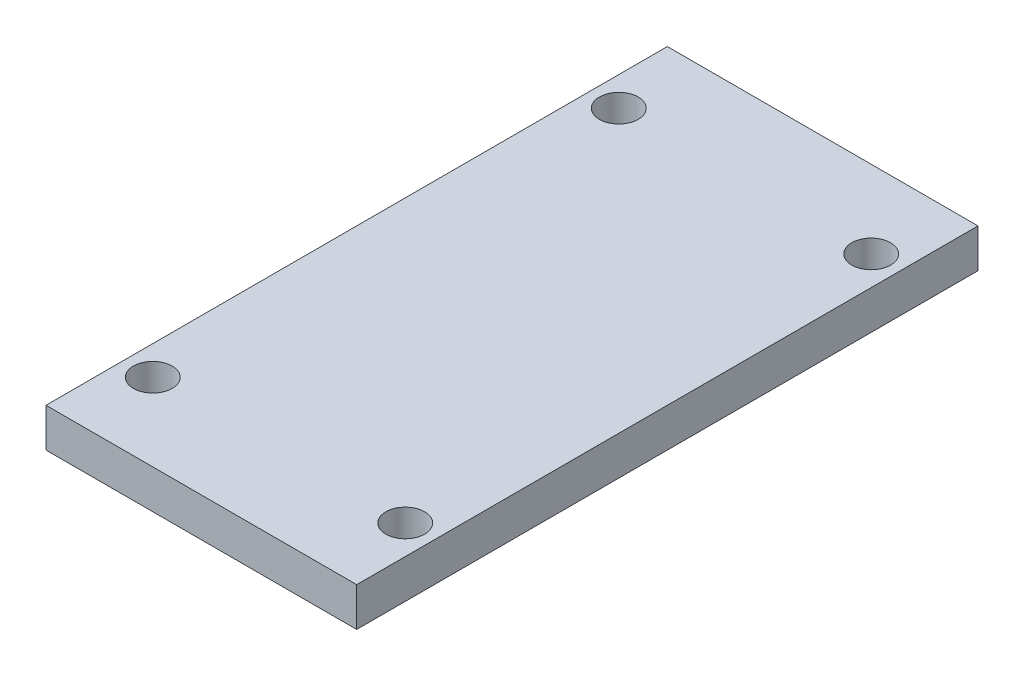
ISO-10303-21;
HEADER;
FILE_DESCRIPTION(('STEP AP214'),'2;1');
FILE_NAME('part.step','',(''),(''),'','','');
FILE_SCHEMA(('AUTOMOTIVE_DESIGN { 1 0 10303 214 1 1 1 1 }'));
ENDSEC;
DATA;
#1=APPLICATION_CONTEXT('core data for automotive mechanical design processes');
#2=APPLICATION_PROTOCOL_DEFINITION('international standard','automotive_design',2000,#1);
#3=PRODUCT_CONTEXT('',#1,'mechanical');
#4=PRODUCT('Part','Part','',(#3));
#5=PRODUCT_RELATED_PRODUCT_CATEGORY('part','',(#4));
#6=PRODUCT_DEFINITION_FORMATION('','',#4);
#7=PRODUCT_DEFINITION_CONTEXT('part definition',#1,'design');
#8=PRODUCT_DEFINITION('design','',#6,#7);
#9=PRODUCT_DEFINITION_SHAPE('','',#8);
#10=(LENGTH_UNIT() NAMED_UNIT(*) SI_UNIT(.MILLI.,.METRE.));
#11=(NAMED_UNIT(*) PLANE_ANGLE_UNIT() SI_UNIT($,.RADIAN.));
#12=(NAMED_UNIT(*) SI_UNIT($,.STERADIAN.) SOLID_ANGLE_UNIT());
#13=UNCERTAINTY_MEASURE_WITH_UNIT(LENGTH_MEASURE(1.E-05),#10,'distance_accuracy_value','');
#14=(GEOMETRIC_REPRESENTATION_CONTEXT(3) GLOBAL_UNCERTAINTY_ASSIGNED_CONTEXT((#13)) GLOBAL_UNIT_ASSIGNED_CONTEXT((#10,
#11,#12)) REPRESENTATION_CONTEXT('',''));
#15=CARTESIAN_POINT('',(0.,0.,0.));
#16=DIRECTION('',(0.,0.,1.));
#17=DIRECTION('',(1.,0.,0.));
#18=AXIS2_PLACEMENT_3D('',#15,#16,#17);
#19=CARTESIAN_POINT('',(0.,10.,0.));
#20=DIRECTION('',(1.,0.,0.));
#21=DIRECTION('',(0.,0.,-1.));
#22=AXIS2_PLACEMENT_3D('',#19,#20,#21);
#23=PLANE('',#22);
#24=DIRECTION('',(0.,0.,1.));
#25=VECTOR('',#24,1.);
#26=CARTESIAN_POINT('',(0.,0.,0.));
#27=LINE('',#26,#25);
#28=CARTESIAN_POINT('',(0.,0.,0.));
#29=VERTEX_POINT('',#28);
#30=CARTESIAN_POINT('',(0.,0.,160.));
#31=VERTEX_POINT('',#30);
#32=EDGE_CURVE('E105',#29,#31,#27,.T.);
#33=ORIENTED_EDGE('',*,*,#32,.T.);
#34=DIRECTION('',(0.,-1.,0.));
#35=VECTOR('',#34,1.);
#36=CARTESIAN_POINT('',(0.,10.,160.));
#37=LINE('',#36,#35);
#38=CARTESIAN_POINT('',(0.,10.,160.));
#39=VERTEX_POINT('',#38);
#40=EDGE_CURVE('E11',#39,#31,#37,.T.);
#41=ORIENTED_EDGE('',*,*,#40,.F.);
#42=DIRECTION('',(0.,0.,1.));
#43=VECTOR('',#42,1.);
#44=CARTESIAN_POINT('',(0.,10.,0.));
#45=LINE('',#44,#43);
#46=CARTESIAN_POINT('',(0.,10.,0.));
#47=VERTEX_POINT('',#46);
#48=EDGE_CURVE('E93',#47,#39,#45,.T.);
#49=ORIENTED_EDGE('',*,*,#48,.F.);
#50=DIRECTION('',(0.,-1.,0.));
#51=VECTOR('',#50,1.);
#52=CARTESIAN_POINT('',(0.,10.,0.));
#53=LINE('',#52,#51);
#54=EDGE_CURVE('E101',#47,#29,#53,.T.);
#55=ORIENTED_EDGE('',*,*,#54,.T.);
#56=EDGE_LOOP('',(#33,#41,#49,#55));
#57=FACE_BOUND('',#56,.T.);
#58=ADVANCED_FACE('F42',(#57),#23,.F.);
#59=CARTESIAN_POINT('',(0.,10.,160.));
#60=DIRECTION('',(0.,0.,-1.));
#61=DIRECTION('',(-1.,0.,0.));
#62=AXIS2_PLACEMENT_3D('',#59,#60,#61);
#63=PLANE('',#62);
#64=DIRECTION('',(1.,0.,0.));
#65=VECTOR('',#64,1.);
#66=CARTESIAN_POINT('',(0.,0.,160.));
#67=LINE('',#66,#65);
#68=CARTESIAN_POINT('',(80.,0.,160.));
#69=VERTEX_POINT('',#68);
#70=EDGE_CURVE('E97',#31,#69,#67,.T.);
#71=ORIENTED_EDGE('',*,*,#70,.T.);
#72=DIRECTION('',(0.,-1.,0.));
#73=VECTOR('',#72,1.);
#74=CARTESIAN_POINT('',(80.,10.,160.));
#75=LINE('',#74,#73);
#76=CARTESIAN_POINT('',(80.,10.,160.));
#77=VERTEX_POINT('',#76);
#78=EDGE_CURVE('E50',#77,#69,#75,.T.);
#79=ORIENTED_EDGE('',*,*,#78,.F.);
#80=DIRECTION('',(1.,0.,0.));
#81=VECTOR('',#80,1.);
#82=CARTESIAN_POINT('',(0.,10.,160.));
#83=LINE('',#82,#81);
#84=EDGE_CURVE('E88',#39,#77,#83,.T.);
#85=ORIENTED_EDGE('',*,*,#84,.F.);
#86=ORIENTED_EDGE('',*,*,#40,.T.);
#87=EDGE_LOOP('',(#71,#79,#85,#86));
#88=FACE_BOUND('',#87,.T.);
#89=ADVANCED_FACE('F96',(#88),#63,.F.);
#90=CARTESIAN_POINT('',(80.,10.,0.));
#91=DIRECTION('',(-1.,0.,0.));
#92=DIRECTION('',(0.,0.,1.));
#93=AXIS2_PLACEMENT_3D('',#90,#91,#92);
#94=PLANE('',#93);
#95=DIRECTION('',(0.,0.,-1.));
#96=VECTOR('',#95,1.);
#97=CARTESIAN_POINT('',(80.,0.,0.));
#98=LINE('',#97,#96);
#99=CARTESIAN_POINT('',(80.,0.,0.));
#100=VERTEX_POINT('',#99);
#101=EDGE_CURVE('E75',#69,#100,#98,.T.);
#102=ORIENTED_EDGE('',*,*,#101,.T.);
#103=DIRECTION('',(0.,-1.,0.));
#104=VECTOR('',#103,1.);
#105=CARTESIAN_POINT('',(80.,10.,0.));
#106=LINE('',#105,#104);
#107=CARTESIAN_POINT('',(80.,10.,0.));
#108=VERTEX_POINT('',#107);
#109=EDGE_CURVE('E98',#108,#100,#106,.T.);
#110=ORIENTED_EDGE('',*,*,#109,.F.);
#111=DIRECTION('',(0.,0.,-1.));
#112=VECTOR('',#111,1.);
#113=CARTESIAN_POINT('',(80.,10.,0.));
#114=LINE('',#113,#112);
#115=EDGE_CURVE('E91',#77,#108,#114,.T.);
#116=ORIENTED_EDGE('',*,*,#115,.F.);
#117=ORIENTED_EDGE('',*,*,#78,.T.);
#118=EDGE_LOOP('',(#102,#110,#116,#117));
#119=FACE_BOUND('',#118,.T.);
#120=ADVANCED_FACE('F99',(#119),#94,.F.);
#121=CARTESIAN_POINT('',(0.,10.,0.));
#122=DIRECTION('',(0.,0.,1.));
#123=DIRECTION('',(1.,0.,0.));
#124=AXIS2_PLACEMENT_3D('',#121,#122,#123);
#125=PLANE('',#124);
#126=DIRECTION('',(-1.,0.,0.));
#127=VECTOR('',#126,1.);
#128=CARTESIAN_POINT('',(0.,0.,0.));
#129=LINE('',#128,#127);
#130=EDGE_CURVE('E81',#100,#29,#129,.T.);
#131=ORIENTED_EDGE('',*,*,#130,.T.);
#132=ORIENTED_EDGE('',*,*,#54,.F.);
#133=DIRECTION('',(-1.,0.,0.));
#134=VECTOR('',#133,1.);
#135=CARTESIAN_POINT('',(0.,10.,0.));
#136=LINE('',#135,#134);
#137=EDGE_CURVE('E58',#108,#47,#136,.T.);
#138=ORIENTED_EDGE('',*,*,#137,.F.);
#139=ORIENTED_EDGE('',*,*,#109,.T.);
#140=EDGE_LOOP('',(#131,#132,#138,#139));
#141=FACE_BOUND('',#140,.T.);
#142=ADVANCED_FACE('F113',(#141),#125,.F.);
#143=CARTESIAN_POINT('',(0.,10.,0.));
#144=DIRECTION('',(0.,1.,0.));
#145=DIRECTION('',(0.,0.,1.));
#146=AXIS2_PLACEMENT_3D('',#143,#144,#145);
#147=PLANE('',#146);
#148=CARTESIAN_POINT('',(7.50000000000002,10.,20.));
#149=DIRECTION('',(0.,1.,0.));
#150=DIRECTION('',(0.,0.,-1.));
#151=AXIS2_PLACEMENT_3D('',#148,#149,#150);
#152=CIRCLE('',#151,5.);
#153=CARTESIAN_POINT('',(7.50000000000002,10.,15.));
#154=VERTEX_POINT('',#153);
#155=EDGE_CURVE('E128',#154,#154,#152,.T.);
#156=ORIENTED_EDGE('',*,*,#155,.F.);
#157=EDGE_LOOP('',(#156));
#158=FACE_BOUND('',#157,.T.);
#159=CARTESIAN_POINT('',(72.5,10.,20.));
#160=DIRECTION('',(0.,1.,0.));
#161=DIRECTION('',(0.,0.,1.));
#162=AXIS2_PLACEMENT_3D('',#159,#160,#161);
#163=CIRCLE('',#162,5.);
#164=CARTESIAN_POINT('',(72.5,10.,25.));
#165=VERTEX_POINT('',#164);
#166=EDGE_CURVE('E134',#165,#165,#163,.T.);
#167=ORIENTED_EDGE('',*,*,#166,.F.);
#168=EDGE_LOOP('',(#167));
#169=FACE_BOUND('',#168,.T.);
#170=CARTESIAN_POINT('',(72.5,10.,140.));
#171=DIRECTION('',(0.,1.,0.));
#172=DIRECTION('',(0.,0.,-1.));
#173=AXIS2_PLACEMENT_3D('',#170,#171,#172);
#174=CIRCLE('',#173,5.00000000000001);
#175=CARTESIAN_POINT('',(72.5,10.,135.));
#176=VERTEX_POINT('',#175);
#177=EDGE_CURVE('E122',#176,#176,#174,.T.);
#178=ORIENTED_EDGE('',*,*,#177,.F.);
#179=EDGE_LOOP('',(#178));
#180=FACE_BOUND('',#179,.T.);
#181=CARTESIAN_POINT('',(7.50000000000002,10.,140.));
#182=DIRECTION('',(0.,1.,0.));
#183=DIRECTION('',(0.,0.,1.));
#184=AXIS2_PLACEMENT_3D('',#181,#182,#183);
#185=CIRCLE('',#184,5.);
#186=CARTESIAN_POINT('',(7.50000000000002,10.,145.));
#187=VERTEX_POINT('',#186);
#188=EDGE_CURVE('E119',#187,#187,#185,.T.);
#189=ORIENTED_EDGE('',*,*,#188,.F.);
#190=EDGE_LOOP('',(#189));
#191=FACE_BOUND('',#190,.T.);
#192=ORIENTED_EDGE('',*,*,#48,.T.);
#193=ORIENTED_EDGE('',*,*,#84,.T.);
#194=ORIENTED_EDGE('',*,*,#115,.T.);
#195=ORIENTED_EDGE('',*,*,#137,.T.);
#196=EDGE_LOOP('',(#192,#193,#194,#195));
#197=FACE_BOUND('',#196,.T.);
#198=ADVANCED_FACE('F89',(#158,#169,#180,#191,#197),#147,.T.);
#199=CARTESIAN_POINT('',(0.,0.,0.));
#200=DIRECTION('',(0.,1.,0.));
#201=DIRECTION('',(0.,0.,1.));
#202=AXIS2_PLACEMENT_3D('',#199,#200,#201);
#203=PLANE('',#202);
#204=CARTESIAN_POINT('',(7.50000000000002,0.,20.));
#205=DIRECTION('',(0.,1.,0.));
#206=DIRECTION('',(0.,0.,-1.));
#207=AXIS2_PLACEMENT_3D('',#204,#205,#206);
#208=CIRCLE('',#207,5.);
#209=CARTESIAN_POINT('',(7.50000000000002,0.,15.));
#210=VERTEX_POINT('',#209);
#211=EDGE_CURVE('E125',#210,#210,#208,.T.);
#212=ORIENTED_EDGE('',*,*,#211,.T.);
#213=EDGE_LOOP('',(#212));
#214=FACE_BOUND('',#213,.T.);
#215=CARTESIAN_POINT('',(72.5,0.,20.));
#216=DIRECTION('',(0.,1.,0.));
#217=DIRECTION('',(0.,0.,1.));
#218=AXIS2_PLACEMENT_3D('',#215,#216,#217);
#219=CIRCLE('',#218,5.);
#220=CARTESIAN_POINT('',(72.5,0.,25.));
#221=VERTEX_POINT('',#220);
#222=EDGE_CURVE('E131',#221,#221,#219,.T.);
#223=ORIENTED_EDGE('',*,*,#222,.T.);
#224=EDGE_LOOP('',(#223));
#225=FACE_BOUND('',#224,.T.);
#226=CARTESIAN_POINT('',(72.5,0.,140.));
#227=DIRECTION('',(0.,1.,0.));
#228=DIRECTION('',(0.,0.,-1.));
#229=AXIS2_PLACEMENT_3D('',#226,#227,#228);
#230=CIRCLE('',#229,5.00000000000001);
#231=CARTESIAN_POINT('',(72.5,0.,135.));
#232=VERTEX_POINT('',#231);
#233=EDGE_CURVE('E137',#232,#232,#230,.T.);
#234=ORIENTED_EDGE('',*,*,#233,.T.);
#235=EDGE_LOOP('',(#234));
#236=FACE_BOUND('',#235,.T.);
#237=CARTESIAN_POINT('',(7.50000000000002,0.,140.));
#238=DIRECTION('',(0.,1.,0.));
#239=DIRECTION('',(0.,0.,1.));
#240=AXIS2_PLACEMENT_3D('',#237,#238,#239);
#241=CIRCLE('',#240,5.);
#242=CARTESIAN_POINT('',(7.50000000000002,0.,145.));
#243=VERTEX_POINT('',#242);
#244=EDGE_CURVE('E108',#243,#243,#241,.T.);
#245=ORIENTED_EDGE('',*,*,#244,.T.);
#246=EDGE_LOOP('',(#245));
#247=FACE_BOUND('',#246,.T.);
#248=ORIENTED_EDGE('',*,*,#32,.F.);
#249=ORIENTED_EDGE('',*,*,#130,.F.);
#250=ORIENTED_EDGE('',*,*,#101,.F.);
#251=ORIENTED_EDGE('',*,*,#70,.F.);
#252=EDGE_LOOP('',(#248,#249,#250,#251));
#253=FACE_BOUND('',#252,.T.);
#254=ADVANCED_FACE('F116',(#214,#225,#236,#247,#253),#203,.F.);
#255=CARTESIAN_POINT('',(7.50000000000002,0.,140.));
#256=DIRECTION('',(0.,1.,0.));
#257=DIRECTION('',(0.,0.,1.));
#258=AXIS2_PLACEMENT_3D('',#255,#256,#257);
#259=CYLINDRICAL_SURFACE('',#258,5.);
#260=ORIENTED_EDGE('',*,*,#244,.F.);
#261=EDGE_LOOP('',(#260));
#262=FACE_BOUND('',#261,.T.);
#263=ORIENTED_EDGE('',*,*,#188,.T.);
#264=EDGE_LOOP('',(#263));
#265=FACE_BOUND('',#264,.T.);
#266=ADVANCED_FACE('F151',(#262,#265),#259,.F.);
#267=CARTESIAN_POINT('',(72.5,0.,140.));
#268=DIRECTION('',(0.,1.,0.));
#269=DIRECTION('',(0.,0.,1.));
#270=AXIS2_PLACEMENT_3D('',#267,#268,#269);
#271=CYLINDRICAL_SURFACE('',#270,5.00000000000001);
#272=ORIENTED_EDGE('',*,*,#233,.F.);
#273=EDGE_LOOP('',(#272));
#274=FACE_BOUND('',#273,.T.);
#275=ORIENTED_EDGE('',*,*,#177,.T.);
#276=EDGE_LOOP('',(#275));
#277=FACE_BOUND('',#276,.T.);
#278=ADVANCED_FACE('F143',(#274,#277),#271,.F.);
#279=CARTESIAN_POINT('',(72.5,0.,20.));
#280=DIRECTION('',(0.,1.,0.));
#281=DIRECTION('',(0.,0.,1.));
#282=AXIS2_PLACEMENT_3D('',#279,#280,#281);
#283=CYLINDRICAL_SURFACE('',#282,5.);
#284=ORIENTED_EDGE('',*,*,#222,.F.);
#285=EDGE_LOOP('',(#284));
#286=FACE_BOUND('',#285,.T.);
#287=ORIENTED_EDGE('',*,*,#166,.T.);
#288=EDGE_LOOP('',(#287));
#289=FACE_BOUND('',#288,.T.);
#290=ADVANCED_FACE('F159',(#286,#289),#283,.F.);
#291=CARTESIAN_POINT('',(7.50000000000002,0.,20.));
#292=DIRECTION('',(0.,1.,0.));
#293=DIRECTION('',(0.,0.,1.));
#294=AXIS2_PLACEMENT_3D('',#291,#292,#293);
#295=CYLINDRICAL_SURFACE('',#294,5.);
#296=ORIENTED_EDGE('',*,*,#211,.F.);
#297=EDGE_LOOP('',(#296));
#298=FACE_BOUND('',#297,.T.);
#299=ORIENTED_EDGE('',*,*,#155,.T.);
#300=EDGE_LOOP('',(#299));
#301=FACE_BOUND('',#300,.T.);
#302=ADVANCED_FACE('F213',(#298,#301),#295,.F.);
#303=CLOSED_SHELL('',(#58,#89,#120,#142,#198,#254,#266,#278,#290,#302));
#304=MANIFOLD_SOLID_BREP('B2',#303);
#305=ADVANCED_BREP_SHAPE_REPRESENTATION('',(#18,#304),#14);
#306=SHAPE_DEFINITION_REPRESENTATION(#9,#305);
ENDSEC;
END-ISO-10303-21;
